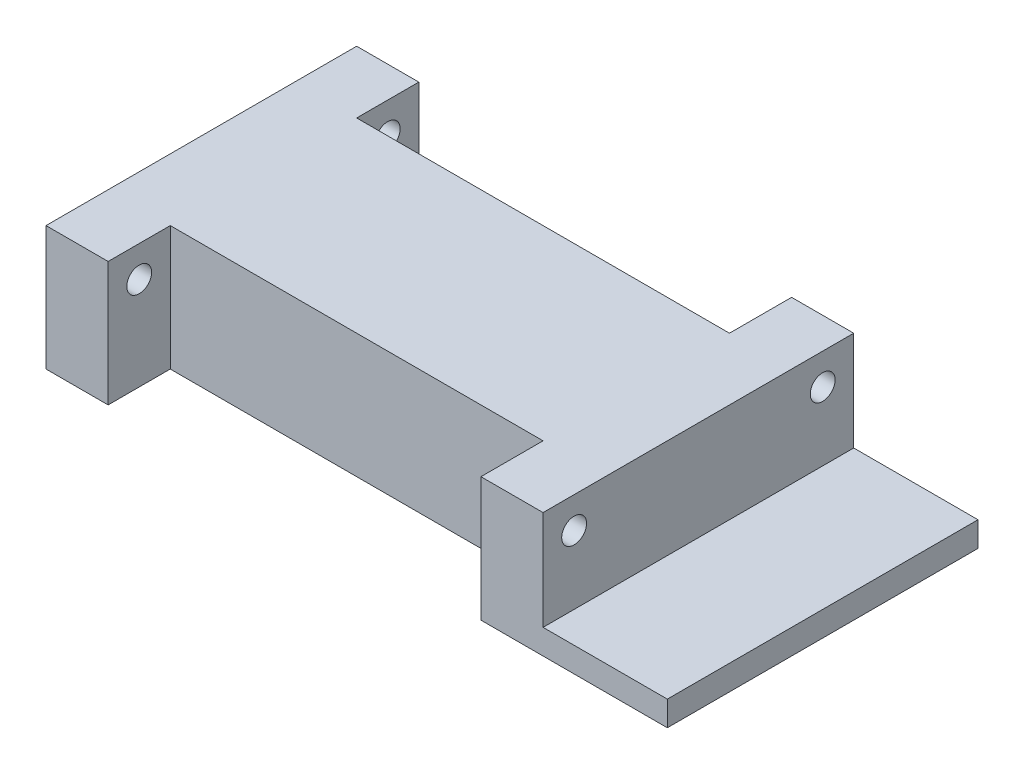
ISO-10303-21;
HEADER;
FILE_DESCRIPTION(('STEP AP214'),'2;1');
FILE_NAME('part.step','',(''),(''),'','','');
FILE_SCHEMA(('AUTOMOTIVE_DESIGN { 1 0 10303 214 1 1 1 1 }'));
ENDSEC;
DATA;
#1=APPLICATION_CONTEXT('core data for automotive mechanical design processes');
#2=APPLICATION_PROTOCOL_DEFINITION('international standard','automotive_design',2000,#1);
#3=PRODUCT_CONTEXT('',#1,'mechanical');
#4=PRODUCT('Part','Part','',(#3));
#5=PRODUCT_RELATED_PRODUCT_CATEGORY('part','',(#4));
#6=PRODUCT_DEFINITION_FORMATION('','',#4);
#7=PRODUCT_DEFINITION_CONTEXT('part definition',#1,'design');
#8=PRODUCT_DEFINITION('design','',#6,#7);
#9=PRODUCT_DEFINITION_SHAPE('','',#8);
#10=(LENGTH_UNIT() NAMED_UNIT(*) SI_UNIT(.MILLI.,.METRE.));
#11=(NAMED_UNIT(*) PLANE_ANGLE_UNIT() SI_UNIT($,.RADIAN.));
#12=(NAMED_UNIT(*) SI_UNIT($,.STERADIAN.) SOLID_ANGLE_UNIT());
#13=UNCERTAINTY_MEASURE_WITH_UNIT(LENGTH_MEASURE(1.E-05),#10,'distance_accuracy_value','');
#14=(GEOMETRIC_REPRESENTATION_CONTEXT(3) GLOBAL_UNCERTAINTY_ASSIGNED_CONTEXT((#13)) GLOBAL_UNIT_ASSIGNED_CONTEXT((#10,
#11,#12)) REPRESENTATION_CONTEXT('',''));
#15=CARTESIAN_POINT('',(0.,0.,0.));
#16=DIRECTION('',(0.,0.,1.));
#17=DIRECTION('',(1.,0.,0.));
#18=AXIS2_PLACEMENT_3D('',#15,#16,#17);
#19=CARTESIAN_POINT('',(400.,50.,0.));
#20=DIRECTION('',(-1.,0.,0.));
#21=DIRECTION('',(0.,0.,1.));
#22=AXIS2_PLACEMENT_3D('',#19,#20,#21);
#23=PLANE('',#22);
#24=CARTESIAN_POINT('',(400.,25.,25.));
#25=DIRECTION('',(1.,0.,0.));
#26=DIRECTION('',(0.,0.,-1.));
#27=AXIS2_PLACEMENT_3D('',#24,#25,#26);
#28=CIRCLE('',#27,10.);
#29=CARTESIAN_POINT('',(400.,25.,15.));
#30=VERTEX_POINT('',#29);
#31=EDGE_CURVE('E210',#30,#30,#28,.T.);
#32=ORIENTED_EDGE('',*,*,#31,.F.);
#33=EDGE_LOOP('',(#32));
#34=FACE_BOUND('',#33,.T.);
#35=CARTESIAN_POINT('',(400.,25.,-175.));
#36=DIRECTION('',(1.,0.,0.));
#37=DIRECTION('',(0.,0.,-1.));
#38=AXIS2_PLACEMENT_3D('',#35,#36,#37);
#39=CIRCLE('',#38,10.);
#40=CARTESIAN_POINT('',(400.,25.,-185.));
#41=VERTEX_POINT('',#40);
#42=EDGE_CURVE('E201',#41,#41,#39,.T.);
#43=ORIENTED_EDGE('',*,*,#42,.F.);
#44=EDGE_LOOP('',(#43));
#45=FACE_BOUND('',#44,.T.);
#46=DIRECTION('',(0.,0.,1.));
#47=VECTOR('',#46,1.);
#48=CARTESIAN_POINT('',(400.,-30.,50.));
#49=LINE('',#48,#47);
#50=CARTESIAN_POINT('',(400.,-30.,-200.));
#51=VERTEX_POINT('',#50);
#52=CARTESIAN_POINT('',(400.,-30.,50.));
#53=VERTEX_POINT('',#52);
#54=EDGE_CURVE('E52',#51,#53,#49,.T.);
#55=ORIENTED_EDGE('',*,*,#54,.F.);
#56=DIRECTION('',(0.,1.,0.));
#57=VECTOR('',#56,1.);
#58=CARTESIAN_POINT('',(400.,0.,-200.));
#59=LINE('',#58,#57);
#60=CARTESIAN_POINT('',(400.,50.,-200.));
#61=VERTEX_POINT('',#60);
#62=EDGE_CURVE('E244',#51,#61,#59,.T.);
#63=ORIENTED_EDGE('',*,*,#62,.T.);
#64=DIRECTION('',(0.,0.,-1.));
#65=VECTOR('',#64,1.);
#66=CARTESIAN_POINT('',(400.,50.,0.));
#67=LINE('',#66,#65);
#68=CARTESIAN_POINT('',(400.,50.,50.));
#69=VERTEX_POINT('',#68);
#70=EDGE_CURVE('E44',#69,#61,#67,.T.);
#71=ORIENTED_EDGE('',*,*,#70,.F.);
#72=DIRECTION('',(0.,-1.,0.));
#73=VECTOR('',#72,1.);
#74=CARTESIAN_POINT('',(400.,0.,50.));
#75=LINE('',#74,#73);
#76=EDGE_CURVE('E257',#69,#53,#75,.T.);
#77=ORIENTED_EDGE('',*,*,#76,.T.);
#78=EDGE_LOOP('',(#55,#63,#71,#77));
#79=FACE_BOUND('',#78,.T.);
#80=ADVANCED_FACE('F35',(#34,#45,#79),#23,.F.);
#81=CARTESIAN_POINT('',(0.,50.,0.));
#82=DIRECTION('',(0.,0.,-1.));
#83=DIRECTION('',(-1.,0.,0.));
#84=AXIS2_PLACEMENT_3D('',#81,#82,#83);
#85=PLANE('',#84);
#86=DIRECTION('',(0.,1.,0.));
#87=VECTOR('',#86,1.);
#88=CARTESIAN_POINT('',(50.,0.,0.));
#89=LINE('',#88,#87);
#90=CARTESIAN_POINT('',(50.,-50.,0.));
#91=VERTEX_POINT('',#90);
#92=CARTESIAN_POINT('',(50.,50.,0.));
#93=VERTEX_POINT('',#92);
#94=EDGE_CURVE('E233',#91,#93,#89,.T.);
#95=ORIENTED_EDGE('',*,*,#94,.F.);
#96=DIRECTION('',(-1.,0.,0.));
#97=VECTOR('',#96,1.);
#98=CARTESIAN_POINT('',(350.,-50.,0.));
#99=LINE('',#98,#97);
#100=CARTESIAN_POINT('',(350.,-50.,0.));
#101=VERTEX_POINT('',#100);
#102=EDGE_CURVE('E195',#101,#91,#99,.T.);
#103=ORIENTED_EDGE('',*,*,#102,.F.);
#104=DIRECTION('',(0.,1.,0.));
#105=VECTOR('',#104,1.);
#106=CARTESIAN_POINT('',(350.,0.,0.));
#107=LINE('',#106,#105);
#108=CARTESIAN_POINT('',(350.,50.,0.));
#109=VERTEX_POINT('',#108);
#110=EDGE_CURVE('E258',#101,#109,#107,.T.);
#111=ORIENTED_EDGE('',*,*,#110,.T.);
#112=DIRECTION('',(1.,0.,0.));
#113=VECTOR('',#112,1.);
#114=CARTESIAN_POINT('',(0.,50.,0.));
#115=LINE('',#114,#113);
#116=EDGE_CURVE('E271',#93,#109,#115,.T.);
#117=ORIENTED_EDGE('',*,*,#116,.F.);
#118=EDGE_LOOP('',(#95,#103,#111,#117));
#119=FACE_BOUND('',#118,.T.);
#120=ADVANCED_FACE('F291',(#119),#85,.F.);
#121=CARTESIAN_POINT('',(0.,50.,0.));
#122=DIRECTION('',(1.,0.,0.));
#123=DIRECTION('',(0.,0.,-1.));
#124=AXIS2_PLACEMENT_3D('',#121,#122,#123);
#125=PLANE('',#124);
#126=CARTESIAN_POINT('',(0.,25.,-175.));
#127=DIRECTION('',(1.,0.,0.));
#128=DIRECTION('',(0.,0.,-1.));
#129=AXIS2_PLACEMENT_3D('',#126,#127,#128);
#130=CIRCLE('',#129,10.);
#131=CARTESIAN_POINT('',(0.,25.,-185.));
#132=VERTEX_POINT('',#131);
#133=EDGE_CURVE('E207',#132,#132,#130,.T.);
#134=ORIENTED_EDGE('',*,*,#133,.T.);
#135=EDGE_LOOP('',(#134));
#136=FACE_BOUND('',#135,.T.);
#137=CARTESIAN_POINT('',(0.,25.,25.));
#138=DIRECTION('',(1.,0.,0.));
#139=DIRECTION('',(0.,0.,-1.));
#140=AXIS2_PLACEMENT_3D('',#137,#138,#139);
#141=CIRCLE('',#140,10.);
#142=CARTESIAN_POINT('',(0.,25.,15.));
#143=VERTEX_POINT('',#142);
#144=EDGE_CURVE('E217',#143,#143,#141,.T.);
#145=ORIENTED_EDGE('',*,*,#144,.T.);
#146=EDGE_LOOP('',(#145));
#147=FACE_BOUND('',#146,.T.);
#148=DIRECTION('',(0.,1.,0.));
#149=VECTOR('',#148,1.);
#150=CARTESIAN_POINT('',(0.,0.,-200.));
#151=LINE('',#150,#149);
#152=CARTESIAN_POINT('',(0.,-50.,-200.));
#153=VERTEX_POINT('',#152);
#154=CARTESIAN_POINT('',(0.,50.,-200.));
#155=VERTEX_POINT('',#154);
#156=EDGE_CURVE('E220',#153,#155,#151,.T.);
#157=ORIENTED_EDGE('',*,*,#156,.F.);
#158=DIRECTION('',(0.,0.,-1.));
#159=VECTOR('',#158,1.);
#160=CARTESIAN_POINT('',(0.,-50.,50.));
#161=LINE('',#160,#159);
#162=CARTESIAN_POINT('',(0.,-50.,50.));
#163=VERTEX_POINT('',#162);
#164=EDGE_CURVE('E179',#163,#153,#161,.T.);
#165=ORIENTED_EDGE('',*,*,#164,.F.);
#166=DIRECTION('',(0.,-1.,0.));
#167=VECTOR('',#166,1.);
#168=CARTESIAN_POINT('',(0.,0.,50.));
#169=LINE('',#168,#167);
#170=CARTESIAN_POINT('',(0.,50.,50.));
#171=VERTEX_POINT('',#170);
#172=EDGE_CURVE('E232',#171,#163,#169,.T.);
#173=ORIENTED_EDGE('',*,*,#172,.F.);
#174=DIRECTION('',(0.,0.,1.));
#175=VECTOR('',#174,1.);
#176=CARTESIAN_POINT('',(0.,50.,0.));
#177=LINE('',#176,#175);
#178=EDGE_CURVE('E269',#155,#171,#177,.T.);
#179=ORIENTED_EDGE('',*,*,#178,.F.);
#180=EDGE_LOOP('',(#157,#165,#173,#179));
#181=FACE_BOUND('',#180,.T.);
#182=ADVANCED_FACE('F37',(#136,#147,#181),#125,.F.);
#183=CARTESIAN_POINT('',(0.,50.,-150.));
#184=DIRECTION('',(0.,0.,1.));
#185=DIRECTION('',(1.,0.,0.));
#186=AXIS2_PLACEMENT_3D('',#183,#184,#185);
#187=PLANE('',#186);
#188=DIRECTION('',(0.,-1.,0.));
#189=VECTOR('',#188,1.);
#190=CARTESIAN_POINT('',(350.,0.,-150.));
#191=LINE('',#190,#189);
#192=CARTESIAN_POINT('',(350.,50.,-150.));
#193=VERTEX_POINT('',#192);
#194=CARTESIAN_POINT('',(350.,-50.,-150.));
#195=VERTEX_POINT('',#194);
#196=EDGE_CURVE('E245',#193,#195,#191,.T.);
#197=ORIENTED_EDGE('',*,*,#196,.T.);
#198=DIRECTION('',(1.,0.,0.));
#199=VECTOR('',#198,1.);
#200=CARTESIAN_POINT('',(50.,-50.,-150.));
#201=LINE('',#200,#199);
#202=CARTESIAN_POINT('',(50.,-50.,-150.));
#203=VERTEX_POINT('',#202);
#204=EDGE_CURVE('E188',#203,#195,#201,.T.);
#205=ORIENTED_EDGE('',*,*,#204,.F.);
#206=DIRECTION('',(0.,-1.,0.));
#207=VECTOR('',#206,1.);
#208=CARTESIAN_POINT('',(50.,0.,-150.));
#209=LINE('',#208,#207);
#210=CARTESIAN_POINT('',(50.,50.,-150.));
#211=VERTEX_POINT('',#210);
#212=EDGE_CURVE('E60',#211,#203,#209,.T.);
#213=ORIENTED_EDGE('',*,*,#212,.F.);
#214=DIRECTION('',(-1.,0.,0.));
#215=VECTOR('',#214,1.);
#216=CARTESIAN_POINT('',(0.,50.,-150.));
#217=LINE('',#216,#215);
#218=EDGE_CURVE('E11',#193,#211,#217,.T.);
#219=ORIENTED_EDGE('',*,*,#218,.F.);
#220=EDGE_LOOP('',(#197,#205,#213,#219));
#221=FACE_BOUND('',#220,.T.);
#222=ADVANCED_FACE('F290',(#221),#187,.F.);
#223=CARTESIAN_POINT('',(0.,50.,0.));
#224=DIRECTION('',(0.,-1.,0.));
#225=DIRECTION('',(0.,0.,-1.));
#226=AXIS2_PLACEMENT_3D('',#223,#224,#225);
#227=PLANE('',#226);
#228=ORIENTED_EDGE('',*,*,#178,.T.);
#229=DIRECTION('',(-1.,0.,0.));
#230=VECTOR('',#229,1.);
#231=CARTESIAN_POINT('',(50.,50.,50.));
#232=LINE('',#231,#230);
#233=CARTESIAN_POINT('',(50.,50.,50.));
#234=VERTEX_POINT('',#233);
#235=EDGE_CURVE('E240',#234,#171,#232,.T.);
#236=ORIENTED_EDGE('',*,*,#235,.F.);
#237=DIRECTION('',(0.,0.,1.));
#238=VECTOR('',#237,1.);
#239=CARTESIAN_POINT('',(50.,50.,0.));
#240=LINE('',#239,#238);
#241=EDGE_CURVE('E238',#93,#234,#240,.T.);
#242=ORIENTED_EDGE('',*,*,#241,.F.);
#243=ORIENTED_EDGE('',*,*,#116,.T.);
#244=DIRECTION('',(0.,0.,1.));
#245=VECTOR('',#244,1.);
#246=CARTESIAN_POINT('',(350.,50.,0.));
#247=LINE('',#246,#245);
#248=CARTESIAN_POINT('',(350.,50.,50.));
#249=VERTEX_POINT('',#248);
#250=EDGE_CURVE('E261',#109,#249,#247,.T.);
#251=ORIENTED_EDGE('',*,*,#250,.T.);
#252=DIRECTION('',(1.,0.,0.));
#253=VECTOR('',#252,1.);
#254=CARTESIAN_POINT('',(350.,50.,50.));
#255=LINE('',#254,#253);
#256=EDGE_CURVE('E265',#249,#69,#255,.T.);
#257=ORIENTED_EDGE('',*,*,#256,.T.);
#258=ORIENTED_EDGE('',*,*,#70,.T.);
#259=DIRECTION('',(1.,0.,0.));
#260=VECTOR('',#259,1.);
#261=CARTESIAN_POINT('',(350.,50.,-200.));
#262=LINE('',#261,#260);
#263=CARTESIAN_POINT('',(350.,50.,-200.));
#264=VERTEX_POINT('',#263);
#265=EDGE_CURVE('E253',#264,#61,#262,.T.);
#266=ORIENTED_EDGE('',*,*,#265,.F.);
#267=DIRECTION('',(0.,0.,1.));
#268=VECTOR('',#267,1.);
#269=CARTESIAN_POINT('',(350.,50.,-150.));
#270=LINE('',#269,#268);
#271=EDGE_CURVE('E250',#264,#193,#270,.T.);
#272=ORIENTED_EDGE('',*,*,#271,.T.);
#273=ORIENTED_EDGE('',*,*,#218,.T.);
#274=DIRECTION('',(0.,0.,1.));
#275=VECTOR('',#274,1.);
#276=CARTESIAN_POINT('',(50.,50.,-150.));
#277=LINE('',#276,#275);
#278=CARTESIAN_POINT('',(50.,50.,-200.));
#279=VERTEX_POINT('',#278);
#280=EDGE_CURVE('E222',#279,#211,#277,.T.);
#281=ORIENTED_EDGE('',*,*,#280,.F.);
#282=DIRECTION('',(-1.,0.,0.));
#283=VECTOR('',#282,1.);
#284=CARTESIAN_POINT('',(50.,50.,-200.));
#285=LINE('',#284,#283);
#286=EDGE_CURVE('E227',#279,#155,#285,.T.);
#287=ORIENTED_EDGE('',*,*,#286,.T.);
#288=EDGE_LOOP('',(#228,#236,#242,#243,#251,#257,#258,#266,#272,#273,#281,#287));
#289=FACE_BOUND('',#288,.T.);
#290=ADVANCED_FACE('F308',(#289),#227,.F.);
#291=CARTESIAN_POINT('',(350.,0.,50.));
#292=DIRECTION('',(0.,0.,1.));
#293=DIRECTION('',(1.,0.,0.));
#294=AXIS2_PLACEMENT_3D('',#291,#292,#293);
#295=PLANE('',#294);
#296=ORIENTED_EDGE('',*,*,#76,.F.);
#297=ORIENTED_EDGE('',*,*,#256,.F.);
#298=DIRECTION('',(0.,-1.,0.));
#299=VECTOR('',#298,1.);
#300=CARTESIAN_POINT('',(350.,0.,50.));
#301=LINE('',#300,#299);
#302=CARTESIAN_POINT('',(350.,-50.,50.));
#303=VERTEX_POINT('',#302);
#304=EDGE_CURVE('E146',#249,#303,#301,.T.);
#305=ORIENTED_EDGE('',*,*,#304,.T.);
#306=DIRECTION('',(-1.,0.,0.));
#307=VECTOR('',#306,1.);
#308=CARTESIAN_POINT('',(400.,-50.,50.));
#309=LINE('',#308,#307);
#310=CARTESIAN_POINT('',(500.,-50.,50.));
#311=VERTEX_POINT('',#310);
#312=EDGE_CURVE('E138',#311,#303,#309,.T.);
#313=ORIENTED_EDGE('',*,*,#312,.F.);
#314=DIRECTION('',(0.,-1.,0.));
#315=VECTOR('',#314,1.);
#316=CARTESIAN_POINT('',(500.,-50.,50.));
#317=LINE('',#316,#315);
#318=CARTESIAN_POINT('',(500.,-30.,50.));
#319=VERTEX_POINT('',#318);
#320=EDGE_CURVE('E144',#319,#311,#317,.T.);
#321=ORIENTED_EDGE('',*,*,#320,.F.);
#322=DIRECTION('',(-1.,0.,0.));
#323=VECTOR('',#322,1.);
#324=CARTESIAN_POINT('',(500.,-30.,50.));
#325=LINE('',#324,#323);
#326=EDGE_CURVE('E171',#319,#53,#325,.T.);
#327=ORIENTED_EDGE('',*,*,#326,.T.);
#328=EDGE_LOOP('',(#296,#297,#305,#313,#321,#327));
#329=FACE_BOUND('',#328,.T.);
#330=ADVANCED_FACE('F141',(#329),#295,.T.);
#331=CARTESIAN_POINT('',(350.,0.,0.));
#332=DIRECTION('',(1.,0.,0.));
#333=DIRECTION('',(0.,0.,-1.));
#334=AXIS2_PLACEMENT_3D('',#331,#332,#333);
#335=PLANE('',#334);
#336=CARTESIAN_POINT('',(350.,25.,25.));
#337=DIRECTION('',(1.,0.,0.));
#338=DIRECTION('',(0.,0.,-1.));
#339=AXIS2_PLACEMENT_3D('',#336,#337,#338);
#340=CIRCLE('',#339,10.);
#341=CARTESIAN_POINT('',(350.,25.,15.));
#342=VERTEX_POINT('',#341);
#343=EDGE_CURVE('E214',#342,#342,#340,.T.);
#344=ORIENTED_EDGE('',*,*,#343,.T.);
#345=EDGE_LOOP('',(#344));
#346=FACE_BOUND('',#345,.T.);
#347=ORIENTED_EDGE('',*,*,#110,.F.);
#348=DIRECTION('',(0.,0.,-1.));
#349=VECTOR('',#348,1.);
#350=CARTESIAN_POINT('',(350.,-50.,50.));
#351=LINE('',#350,#349);
#352=EDGE_CURVE('E150',#303,#101,#351,.T.);
#353=ORIENTED_EDGE('',*,*,#352,.F.);
#354=ORIENTED_EDGE('',*,*,#304,.F.);
#355=ORIENTED_EDGE('',*,*,#250,.F.);
#356=EDGE_LOOP('',(#347,#353,#354,#355));
#357=FACE_BOUND('',#356,.T.);
#358=ADVANCED_FACE('F317',(#346,#357),#335,.F.);
#359=CARTESIAN_POINT('',(350.,0.,-200.));
#360=DIRECTION('',(0.,0.,-1.));
#361=DIRECTION('',(-1.,0.,0.));
#362=AXIS2_PLACEMENT_3D('',#359,#360,#361);
#363=PLANE('',#362);
#364=ORIENTED_EDGE('',*,*,#62,.F.);
#365=DIRECTION('',(-1.,0.,0.));
#366=VECTOR('',#365,1.);
#367=CARTESIAN_POINT('',(500.,-30.,-200.));
#368=LINE('',#367,#366);
#369=CARTESIAN_POINT('',(500.,-30.,-200.));
#370=VERTEX_POINT('',#369);
#371=EDGE_CURVE('E174',#370,#51,#368,.T.);
#372=ORIENTED_EDGE('',*,*,#371,.F.);
#373=DIRECTION('',(0.,1.,0.));
#374=VECTOR('',#373,1.);
#375=CARTESIAN_POINT('',(500.,-50.,-200.));
#376=LINE('',#375,#374);
#377=CARTESIAN_POINT('',(500.,-50.,-200.));
#378=VERTEX_POINT('',#377);
#379=EDGE_CURVE('E161',#378,#370,#376,.T.);
#380=ORIENTED_EDGE('',*,*,#379,.F.);
#381=DIRECTION('',(1.,0.,0.));
#382=VECTOR('',#381,1.);
#383=CARTESIAN_POINT('',(350.,-50.,-200.));
#384=LINE('',#383,#382);
#385=CARTESIAN_POINT('',(350.,-50.,-200.));
#386=VERTEX_POINT('',#385);
#387=EDGE_CURVE('E151',#386,#378,#384,.T.);
#388=ORIENTED_EDGE('',*,*,#387,.F.);
#389=DIRECTION('',(0.,1.,0.));
#390=VECTOR('',#389,1.);
#391=CARTESIAN_POINT('',(350.,0.,-200.));
#392=LINE('',#391,#390);
#393=EDGE_CURVE('E247',#386,#264,#392,.T.);
#394=ORIENTED_EDGE('',*,*,#393,.T.);
#395=ORIENTED_EDGE('',*,*,#265,.T.);
#396=EDGE_LOOP('',(#364,#372,#380,#388,#394,#395));
#397=FACE_BOUND('',#396,.T.);
#398=ADVANCED_FACE('F310',(#397),#363,.T.);
#399=CARTESIAN_POINT('',(350.,0.,0.));
#400=DIRECTION('',(-1.,0.,0.));
#401=DIRECTION('',(0.,0.,1.));
#402=AXIS2_PLACEMENT_3D('',#399,#400,#401);
#403=PLANE('',#402);
#404=CARTESIAN_POINT('',(350.,25.,-175.));
#405=DIRECTION('',(-1.,0.,0.));
#406=DIRECTION('',(0.,0.,1.));
#407=AXIS2_PLACEMENT_3D('',#404,#405,#406);
#408=CIRCLE('',#407,10.);
#409=CARTESIAN_POINT('',(350.,25.,-165.));
#410=VERTEX_POINT('',#409);
#411=EDGE_CURVE('E204',#410,#410,#408,.T.);
#412=ORIENTED_EDGE('',*,*,#411,.F.);
#413=EDGE_LOOP('',(#412));
#414=FACE_BOUND('',#413,.T.);
#415=ORIENTED_EDGE('',*,*,#196,.F.);
#416=ORIENTED_EDGE('',*,*,#271,.F.);
#417=ORIENTED_EDGE('',*,*,#393,.F.);
#418=DIRECTION('',(0.,0.,-1.));
#419=VECTOR('',#418,1.);
#420=CARTESIAN_POINT('',(350.,-50.,-150.));
#421=LINE('',#420,#419);
#422=EDGE_CURVE('E191',#195,#386,#421,.T.);
#423=ORIENTED_EDGE('',*,*,#422,.F.);
#424=EDGE_LOOP('',(#415,#416,#417,#423));
#425=FACE_BOUND('',#424,.T.);
#426=ADVANCED_FACE('F306',(#414,#425),#403,.T.);
#427=CARTESIAN_POINT('',(50.,0.,50.));
#428=DIRECTION('',(0.,0.,-1.));
#429=DIRECTION('',(-1.,0.,0.));
#430=AXIS2_PLACEMENT_3D('',#427,#428,#429);
#431=PLANE('',#430);
#432=ORIENTED_EDGE('',*,*,#172,.T.);
#433=DIRECTION('',(-1.,0.,0.));
#434=VECTOR('',#433,1.);
#435=CARTESIAN_POINT('',(50.,-50.,50.));
#436=LINE('',#435,#434);
#437=CARTESIAN_POINT('',(50.,-50.,50.));
#438=VERTEX_POINT('',#437);
#439=EDGE_CURVE('E177',#438,#163,#436,.T.);
#440=ORIENTED_EDGE('',*,*,#439,.F.);
#441=DIRECTION('',(0.,-1.,0.));
#442=VECTOR('',#441,1.);
#443=CARTESIAN_POINT('',(50.,0.,50.));
#444=LINE('',#443,#442);
#445=EDGE_CURVE('E236',#234,#438,#444,.T.);
#446=ORIENTED_EDGE('',*,*,#445,.F.);
#447=ORIENTED_EDGE('',*,*,#235,.T.);
#448=EDGE_LOOP('',(#432,#440,#446,#447));
#449=FACE_BOUND('',#448,.T.);
#450=ADVANCED_FACE('F324',(#449),#431,.F.);
#451=CARTESIAN_POINT('',(50.,0.,0.));
#452=DIRECTION('',(-1.,0.,0.));
#453=DIRECTION('',(0.,0.,-1.));
#454=AXIS2_PLACEMENT_3D('',#451,#452,#453);
#455=PLANE('',#454);
#456=CARTESIAN_POINT('',(50.,25.,25.));
#457=DIRECTION('',(-1.,0.,0.));
#458=DIRECTION('',(0.,0.,1.));
#459=AXIS2_PLACEMENT_3D('',#456,#457,#458);
#460=CIRCLE('',#459,10.);
#461=CARTESIAN_POINT('',(50.,25.,35.));
#462=VERTEX_POINT('',#461);
#463=EDGE_CURVE('E213',#462,#462,#460,.T.);
#464=ORIENTED_EDGE('',*,*,#463,.T.);
#465=EDGE_LOOP('',(#464));
#466=FACE_BOUND('',#465,.T.);
#467=ORIENTED_EDGE('',*,*,#94,.T.);
#468=ORIENTED_EDGE('',*,*,#241,.T.);
#469=ORIENTED_EDGE('',*,*,#445,.T.);
#470=DIRECTION('',(0.,0.,1.));
#471=VECTOR('',#470,1.);
#472=CARTESIAN_POINT('',(50.,-50.,0.));
#473=LINE('',#472,#471);
#474=EDGE_CURVE('E198',#91,#438,#473,.T.);
#475=ORIENTED_EDGE('',*,*,#474,.F.);
#476=EDGE_LOOP('',(#467,#468,#469,#475));
#477=FACE_BOUND('',#476,.T.);
#478=ADVANCED_FACE('F277',(#466,#477),#455,.F.);
#479=CARTESIAN_POINT('',(50.,0.,-200.));
#480=DIRECTION('',(0.,0.,1.));
#481=DIRECTION('',(1.,0.,0.));
#482=AXIS2_PLACEMENT_3D('',#479,#480,#481);
#483=PLANE('',#482);
#484=ORIENTED_EDGE('',*,*,#156,.T.);
#485=ORIENTED_EDGE('',*,*,#286,.F.);
#486=DIRECTION('',(0.,1.,0.));
#487=VECTOR('',#486,1.);
#488=CARTESIAN_POINT('',(50.,0.,-200.));
#489=LINE('',#488,#487);
#490=CARTESIAN_POINT('',(50.,-50.,-200.));
#491=VERTEX_POINT('',#490);
#492=EDGE_CURVE('E225',#491,#279,#489,.T.);
#493=ORIENTED_EDGE('',*,*,#492,.F.);
#494=DIRECTION('',(1.,0.,0.));
#495=VECTOR('',#494,1.);
#496=CARTESIAN_POINT('',(0.,-50.,-200.));
#497=LINE('',#496,#495);
#498=EDGE_CURVE('E182',#153,#491,#497,.T.);
#499=ORIENTED_EDGE('',*,*,#498,.F.);
#500=EDGE_LOOP('',(#484,#485,#493,#499));
#501=FACE_BOUND('',#500,.T.);
#502=ADVANCED_FACE('F300',(#501),#483,.F.);
#503=CARTESIAN_POINT('',(50.,0.,0.));
#504=DIRECTION('',(1.,0.,0.));
#505=DIRECTION('',(0.,0.,1.));
#506=AXIS2_PLACEMENT_3D('',#503,#504,#505);
#507=PLANE('',#506);
#508=CARTESIAN_POINT('',(50.,25.,-175.));
#509=DIRECTION('',(1.,0.,0.));
#510=DIRECTION('',(0.,0.,-1.));
#511=AXIS2_PLACEMENT_3D('',#508,#509,#510);
#512=CIRCLE('',#511,10.);
#513=CARTESIAN_POINT('',(50.,25.,-185.));
#514=VERTEX_POINT('',#513);
#515=EDGE_CURVE('E39',#514,#514,#512,.T.);
#516=ORIENTED_EDGE('',*,*,#515,.F.);
#517=EDGE_LOOP('',(#516));
#518=FACE_BOUND('',#517,.T.);
#519=ORIENTED_EDGE('',*,*,#212,.T.);
#520=DIRECTION('',(0.,0.,1.));
#521=VECTOR('',#520,1.);
#522=CARTESIAN_POINT('',(50.,-50.,-200.));
#523=LINE('',#522,#521);
#524=EDGE_CURVE('E185',#491,#203,#523,.T.);
#525=ORIENTED_EDGE('',*,*,#524,.F.);
#526=ORIENTED_EDGE('',*,*,#492,.T.);
#527=ORIENTED_EDGE('',*,*,#280,.T.);
#528=EDGE_LOOP('',(#519,#525,#526,#527));
#529=FACE_BOUND('',#528,.T.);
#530=ADVANCED_FACE('F284',(#518,#529),#507,.T.);
#531=CARTESIAN_POINT('',(-44.0000000000001,25.,25.));
#532=DIRECTION('',(1.,0.,0.));
#533=DIRECTION('',(0.,0.,-1.));
#534=AXIS2_PLACEMENT_3D('',#531,#532,#533);
#535=CYLINDRICAL_SURFACE('',#534,10.);
#536=ORIENTED_EDGE('',*,*,#463,.F.);
#537=EDGE_LOOP('',(#536));
#538=FACE_BOUND('',#537,.T.);
#539=ORIENTED_EDGE('',*,*,#144,.F.);
#540=EDGE_LOOP('',(#539));
#541=FACE_BOUND('',#540,.T.);
#542=ADVANCED_FACE('F280',(#538,#541),#535,.F.);
#543=ORIENTED_EDGE('',*,*,#31,.T.);
#544=EDGE_LOOP('',(#543));
#545=FACE_BOUND('',#544,.T.);
#546=ORIENTED_EDGE('',*,*,#343,.F.);
#547=EDGE_LOOP('',(#546));
#548=FACE_BOUND('',#547,.T.);
#549=ADVANCED_FACE('F283',(#545,#548),#535,.F.);
#550=CARTESIAN_POINT('',(-44.0000000000001,25.,-175.));
#551=DIRECTION('',(1.,0.,0.));
#552=DIRECTION('',(0.,0.,-1.));
#553=AXIS2_PLACEMENT_3D('',#550,#551,#552);
#554=CYLINDRICAL_SURFACE('',#553,10.);
#555=ORIENTED_EDGE('',*,*,#515,.T.);
#556=EDGE_LOOP('',(#555));
#557=FACE_BOUND('',#556,.T.);
#558=ORIENTED_EDGE('',*,*,#133,.F.);
#559=EDGE_LOOP('',(#558));
#560=FACE_BOUND('',#559,.T.);
#561=ADVANCED_FACE('F423',(#557,#560),#554,.F.);
#562=ORIENTED_EDGE('',*,*,#411,.T.);
#563=EDGE_LOOP('',(#562));
#564=FACE_BOUND('',#563,.T.);
#565=ORIENTED_EDGE('',*,*,#42,.T.);
#566=EDGE_LOOP('',(#565));
#567=FACE_BOUND('',#566,.T.);
#568=ADVANCED_FACE('F365',(#564,#567),#554,.F.);
#569=CARTESIAN_POINT('',(0.,-50.,0.));
#570=DIRECTION('',(0.,-1.,0.));
#571=DIRECTION('',(0.,0.,-1.));
#572=AXIS2_PLACEMENT_3D('',#569,#570,#571);
#573=PLANE('',#572);
#574=ORIENTED_EDGE('',*,*,#439,.T.);
#575=ORIENTED_EDGE('',*,*,#164,.T.);
#576=ORIENTED_EDGE('',*,*,#498,.T.);
#577=ORIENTED_EDGE('',*,*,#524,.T.);
#578=ORIENTED_EDGE('',*,*,#204,.T.);
#579=ORIENTED_EDGE('',*,*,#422,.T.);
#580=ORIENTED_EDGE('',*,*,#387,.T.);
#581=DIRECTION('',(0.,0.,-1.));
#582=VECTOR('',#581,1.);
#583=CARTESIAN_POINT('',(500.,-50.,50.));
#584=LINE('',#583,#582);
#585=EDGE_CURVE('E154',#311,#378,#584,.T.);
#586=ORIENTED_EDGE('',*,*,#585,.F.);
#587=ORIENTED_EDGE('',*,*,#312,.T.);
#588=ORIENTED_EDGE('',*,*,#352,.T.);
#589=ORIENTED_EDGE('',*,*,#102,.T.);
#590=ORIENTED_EDGE('',*,*,#474,.T.);
#591=EDGE_LOOP('',(#574,#575,#576,#577,#578,#579,#580,#586,#587,#588,#589,#590));
#592=FACE_BOUND('',#591,.T.);
#593=ADVANCED_FACE('F156',(#592),#573,.T.);
#594=CARTESIAN_POINT('',(500.,-30.,50.));
#595=DIRECTION('',(0.,-1.,0.));
#596=DIRECTION('',(0.,0.,-1.));
#597=AXIS2_PLACEMENT_3D('',#594,#595,#596);
#598=PLANE('',#597);
#599=ORIENTED_EDGE('',*,*,#54,.T.);
#600=ORIENTED_EDGE('',*,*,#326,.F.);
#601=DIRECTION('',(0.,0.,1.));
#602=VECTOR('',#601,1.);
#603=CARTESIAN_POINT('',(500.,-30.,50.));
#604=LINE('',#603,#602);
#605=EDGE_CURVE('E165',#370,#319,#604,.T.);
#606=ORIENTED_EDGE('',*,*,#605,.F.);
#607=ORIENTED_EDGE('',*,*,#371,.T.);
#608=EDGE_LOOP('',(#599,#600,#606,#607));
#609=FACE_BOUND('',#608,.T.);
#610=ADVANCED_FACE('F313',(#609),#598,.F.);
#611=CARTESIAN_POINT('',(500.,0.,0.));
#612=DIRECTION('',(-1.,0.,0.));
#613=DIRECTION('',(0.,0.,1.));
#614=AXIS2_PLACEMENT_3D('',#611,#612,#613);
#615=PLANE('',#614);
#616=ORIENTED_EDGE('',*,*,#320,.T.);
#617=ORIENTED_EDGE('',*,*,#585,.T.);
#618=ORIENTED_EDGE('',*,*,#379,.T.);
#619=ORIENTED_EDGE('',*,*,#605,.T.);
#620=EDGE_LOOP('',(#616,#617,#618,#619));
#621=FACE_BOUND('',#620,.T.);
#622=ADVANCED_FACE('F163',(#621),#615,.F.);
#623=CLOSED_SHELL('',(#80,#120,#182,#222,#290,#330,#358,#398,#426,#450,#478,#502,#530,#542,#549,
#561,#568,#593,#610,#622));
#624=MANIFOLD_SOLID_BREP('B2',#623);
#625=ADVANCED_BREP_SHAPE_REPRESENTATION('',(#18,#624),#14);
#626=SHAPE_DEFINITION_REPRESENTATION(#9,#625);
ENDSEC;
END-ISO-10303-21;
